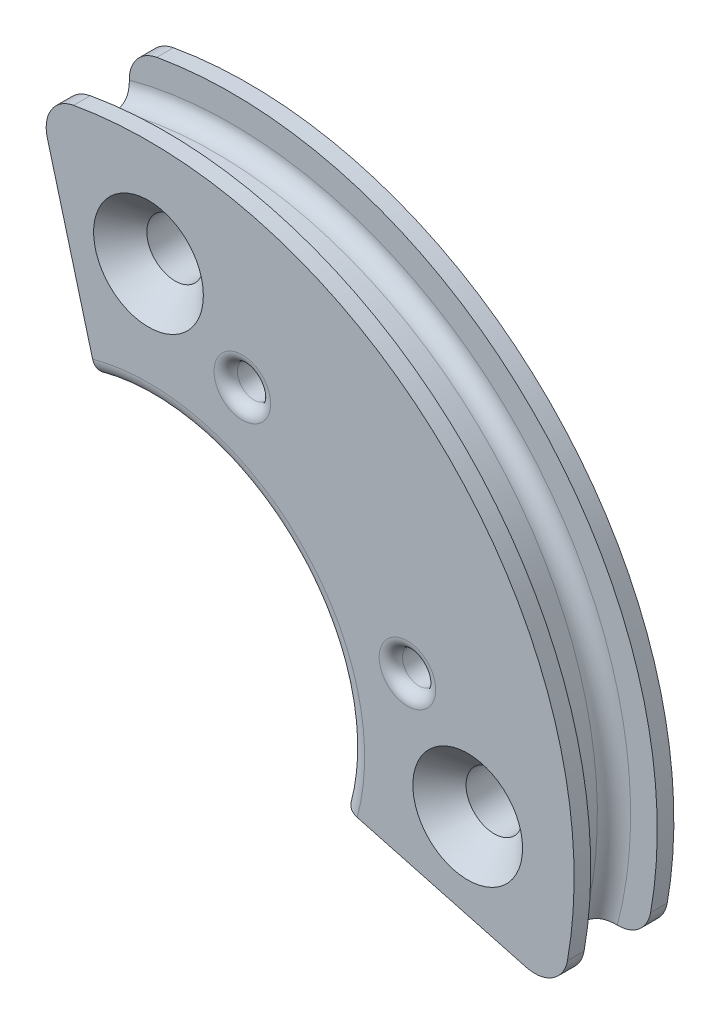
ISO-10303-21;
HEADER;
FILE_DESCRIPTION(('STEP AP214'),'2;1');
FILE_NAME('part.step','',(''),(''),'','','');
FILE_SCHEMA(('AUTOMOTIVE_DESIGN { 1 0 10303 214 1 1 1 1 }'));
ENDSEC;
DATA;
#1=APPLICATION_CONTEXT('core data for automotive mechanical design processes');
#2=APPLICATION_PROTOCOL_DEFINITION('international standard','automotive_design',2000,#1);
#3=PRODUCT_CONTEXT('',#1,'mechanical');
#4=PRODUCT('Part','Part','',(#3));
#5=PRODUCT_RELATED_PRODUCT_CATEGORY('part','',(#4));
#6=PRODUCT_DEFINITION_FORMATION('','',#4);
#7=PRODUCT_DEFINITION_CONTEXT('part definition',#1,'design');
#8=PRODUCT_DEFINITION('design','',#6,#7);
#9=PRODUCT_DEFINITION_SHAPE('','',#8);
#10=(LENGTH_UNIT() NAMED_UNIT(*) SI_UNIT(.MILLI.,.METRE.));
#11=(NAMED_UNIT(*) PLANE_ANGLE_UNIT() SI_UNIT($,.RADIAN.));
#12=(NAMED_UNIT(*) SI_UNIT($,.STERADIAN.) SOLID_ANGLE_UNIT());
#13=UNCERTAINTY_MEASURE_WITH_UNIT(LENGTH_MEASURE(1.E-05),#10,'distance_accuracy_value','');
#14=(GEOMETRIC_REPRESENTATION_CONTEXT(3) GLOBAL_UNCERTAINTY_ASSIGNED_CONTEXT((#13)) GLOBAL_UNIT_ASSIGNED_CONTEXT((#10,
#11,#12)) REPRESENTATION_CONTEXT('',''));
#15=CARTESIAN_POINT('',(0.,0.,0.));
#16=DIRECTION('',(0.,0.,1.));
#17=DIRECTION('',(1.,0.,0.));
#18=AXIS2_PLACEMENT_3D('',#15,#16,#17);
#19=CARTESIAN_POINT('',(0.,0.,1.5));
#20=DIRECTION('',(0.,0.,1.));
#21=DIRECTION('',(1.,0.,0.));
#22=AXIS2_PLACEMENT_3D('',#19,#20,#21);
#23=PLANE('',#22);
#24=CARTESIAN_POINT('',(2.82143232026971,7.78746026853087,1.5));
#25=DIRECTION('',(0.,0.,1.));
#26=DIRECTION('',(1.,0.,0.));
#27=AXIS2_PLACEMENT_3D('',#24,#25,#26);
#28=CIRCLE('',#27,0.85);
#29=CARTESIAN_POINT('',(3.67143232026971,7.78746026853087,1.5));
#30=VERTEX_POINT('',#29);
#31=EDGE_CURVE('E350',#30,#30,#28,.F.);
#32=ORIENTED_EDGE('',*,*,#31,.T.);
#33=EDGE_LOOP('',(#32));
#34=FACE_BOUND('',#33,.T.);
#35=CARTESIAN_POINT('',(7.78746026853084,2.82143232026975,1.5));
#36=DIRECTION('',(0.,0.,1.));
#37=DIRECTION('',(1.,0.,0.));
#38=AXIS2_PLACEMENT_3D('',#35,#36,#37);
#39=CIRCLE('',#38,0.850000000000001);
#40=CARTESIAN_POINT('',(8.63746026853084,2.82143232026975,1.5));
#41=VERTEX_POINT('',#40);
#42=EDGE_CURVE('E347',#41,#41,#39,.F.);
#43=ORIENTED_EDGE('',*,*,#42,.T.);
#44=EDGE_LOOP('',(#43));
#45=FACE_BOUND('',#44,.T.);
#46=CARTESIAN_POINT('',(9.6,0.,1.5));
#47=DIRECTION('',(0.,0.,1.));
#48=DIRECTION('',(1.,0.,0.));
#49=AXIS2_PLACEMENT_3D('',#46,#47,#48);
#50=CIRCLE('',#49,1.65);
#51=CARTESIAN_POINT('',(11.25,0.,1.5));
#52=VERTEX_POINT('',#51);
#53=EDGE_CURVE('E338',#52,#52,#50,.F.);
#54=ORIENTED_EDGE('',*,*,#53,.T.);
#55=EDGE_LOOP('',(#54));
#56=FACE_BOUND('',#55,.T.);
#57=CARTESIAN_POINT('',(1.00554662558682E-13,9.6,1.5));
#58=DIRECTION('',(0.,0.,1.));
#59=DIRECTION('',(1.,0.,0.));
#60=AXIS2_PLACEMENT_3D('',#57,#58,#59);
#61=CIRCLE('',#60,1.65);
#62=CARTESIAN_POINT('',(1.6500000000001,9.6,1.5));
#63=VERTEX_POINT('',#62);
#64=EDGE_CURVE('E335',#63,#63,#61,.F.);
#65=ORIENTED_EDGE('',*,*,#64,.T.);
#66=EDGE_LOOP('',(#65));
#67=FACE_BOUND('',#66,.T.);
#68=DIRECTION('',(-0.965925826289068,0.258819045102521,0.));
#69=VECTOR('',#68,1.);
#70=CARTESIAN_POINT('',(14.9002332262777,-3.9925054600165,1.5));
#71=LINE('',#70,#69);
#72=CARTESIAN_POINT('',(11.3569219381653,-3.0430780618347,1.5));
#73=VERTEX_POINT('',#72);
#74=CARTESIAN_POINT('',(6.27851787087894,-1.68232379316639,1.5));
#75=VERTEX_POINT('',#74);
#76=EDGE_CURVE('E467',#73,#75,#71,.T.);
#77=ORIENTED_EDGE('',*,*,#76,.F.);
#78=CARTESIAN_POINT('',(11.6157409832678,-2.07715223554563,1.5));
#79=DIRECTION('',(0.,0.,1.));
#80=DIRECTION('',(1.,0.,0.));
#81=AXIS2_PLACEMENT_3D('',#78,#79,#80);
#82=CIRCLE('',#81,1.);
#83=CARTESIAN_POINT('',(12.6001258123583,-2.2531820860156,1.5));
#84=VERTEX_POINT('',#83);
#85=EDGE_CURVE('E309',#73,#84,#82,.T.);
#86=ORIENTED_EDGE('',*,*,#85,.T.);
#87=CARTESIAN_POINT('',(0.,0.,1.5));
#88=DIRECTION('',(0.,0.,1.));
#89=DIRECTION('',(1.,0.,0.));
#90=AXIS2_PLACEMENT_3D('',#87,#88,#89);
#91=CIRCLE('',#90,12.8);
#92=CARTESIAN_POINT('',(-2.25318208601565,12.6001258123583,1.5));
#93=VERTEX_POINT('',#92);
#94=EDGE_CURVE('E443',#84,#93,#91,.T.);
#95=ORIENTED_EDGE('',*,*,#94,.T.);
#96=CARTESIAN_POINT('',(-2.07715223554568,11.6157409832678,1.5));
#97=DIRECTION('',(0.,0.,1.));
#98=DIRECTION('',(1.,0.,0.));
#99=AXIS2_PLACEMENT_3D('',#96,#97,#98);
#100=CIRCLE('',#99,1.);
#101=CARTESIAN_POINT('',(-3.04307806183475,11.3569219381653,1.5));
#102=VERTEX_POINT('',#101);
#103=EDGE_CURVE('E306',#93,#102,#100,.T.);
#104=ORIENTED_EDGE('',*,*,#103,.T.);
#105=DIRECTION('',(-0.258819045102525,0.965925826289067,0.));
#106=VECTOR('',#105,1.);
#107=CARTESIAN_POINT('',(-3.74363575167314,13.9714388302752,1.5));
#108=LINE('',#107,#106);
#109=CARTESIAN_POINT('',(-1.68232379316641,6.27851787087894,1.5));
#110=VERTEX_POINT('',#109);
#111=EDGE_CURVE('E465',#110,#102,#108,.T.);
#112=ORIENTED_EDGE('',*,*,#111,.F.);
#113=CARTESIAN_POINT('',(0.,0.,1.5));
#114=DIRECTION('',(0.,0.,1.));
#115=DIRECTION('',(1.,0.,0.));
#116=AXIS2_PLACEMENT_3D('',#113,#114,#115);
#117=CIRCLE('',#116,6.5);
#118=EDGE_CURVE('E192',#110,#75,#117,.F.);
#119=ORIENTED_EDGE('',*,*,#118,.T.);
#120=EDGE_LOOP('',(#77,#86,#95,#104,#112,#119));
#121=FACE_BOUND('',#120,.T.);
#122=ADVANCED_FACE('F33',(#34,#45,#56,#67,#121),#23,.T.);
#123=CARTESIAN_POINT('',(0.,0.,-1.5));
#124=DIRECTION('',(0.,0.,1.));
#125=DIRECTION('',(1.,0.,0.));
#126=AXIS2_PLACEMENT_3D('',#123,#124,#125);
#127=PLANE('',#126);
#128=CARTESIAN_POINT('',(7.78746026853084,2.82143232026975,-1.5));
#129=DIRECTION('',(0.,0.,1.));
#130=DIRECTION('',(1.,0.,0.));
#131=AXIS2_PLACEMENT_3D('',#128,#129,#130);
#132=CIRCLE('',#131,0.850000000000001);
#133=CARTESIAN_POINT('',(8.63746026853084,2.82143232026975,-1.5));
#134=VERTEX_POINT('',#133);
#135=EDGE_CURVE('E358',#134,#134,#132,.T.);
#136=ORIENTED_EDGE('',*,*,#135,.T.);
#137=EDGE_LOOP('',(#136));
#138=FACE_BOUND('',#137,.T.);
#139=CARTESIAN_POINT('',(2.82143232026971,7.78746026853087,-1.5));
#140=DIRECTION('',(0.,0.,1.));
#141=DIRECTION('',(1.,0.,0.));
#142=AXIS2_PLACEMENT_3D('',#139,#140,#141);
#143=CIRCLE('',#142,0.85);
#144=CARTESIAN_POINT('',(3.67143232026971,7.78746026853087,-1.5));
#145=VERTEX_POINT('',#144);
#146=EDGE_CURVE('E355',#145,#145,#143,.T.);
#147=ORIENTED_EDGE('',*,*,#146,.T.);
#148=EDGE_LOOP('',(#147));
#149=FACE_BOUND('',#148,.T.);
#150=CARTESIAN_POINT('',(0.,0.,-1.5));
#151=DIRECTION('',(0.,0.,1.));
#152=DIRECTION('',(1.,0.,0.));
#153=AXIS2_PLACEMENT_3D('',#150,#151,#152);
#154=CIRCLE('',#153,12.8);
#155=CARTESIAN_POINT('',(12.6001258123583,-2.2531820860156,-1.5));
#156=VERTEX_POINT('',#155);
#157=CARTESIAN_POINT('',(-2.25318208601565,12.6001258123583,-1.5));
#158=VERTEX_POINT('',#157);
#159=EDGE_CURVE('E375',#156,#158,#154,.T.);
#160=ORIENTED_EDGE('',*,*,#159,.F.);
#161=CARTESIAN_POINT('',(11.6157409832678,-2.07715223554563,-1.5));
#162=DIRECTION('',(0.,0.,1.));
#163=DIRECTION('',(1.,0.,0.));
#164=AXIS2_PLACEMENT_3D('',#161,#162,#163);
#165=CIRCLE('',#164,1.);
#166=CARTESIAN_POINT('',(11.3569219381653,-3.0430780618347,-1.5));
#167=VERTEX_POINT('',#166);
#168=EDGE_CURVE('E300',#156,#167,#165,.F.);
#169=ORIENTED_EDGE('',*,*,#168,.T.);
#170=DIRECTION('',(-0.965925826289068,0.258819045102521,0.));
#171=VECTOR('',#170,1.);
#172=CARTESIAN_POINT('',(14.9002332262777,-3.9925054600165,-1.5));
#173=LINE('',#172,#171);
#174=CARTESIAN_POINT('',(6.27851787087894,-1.68232379316639,-1.5));
#175=VERTEX_POINT('',#174);
#176=EDGE_CURVE('E463',#167,#175,#173,.T.);
#177=ORIENTED_EDGE('',*,*,#176,.T.);
#178=CARTESIAN_POINT('',(0.,0.,-1.5));
#179=DIRECTION('',(0.,0.,1.));
#180=DIRECTION('',(1.,0.,0.));
#181=AXIS2_PLACEMENT_3D('',#178,#179,#180);
#182=CIRCLE('',#181,6.5);
#183=CARTESIAN_POINT('',(-1.68232379316641,6.27851787087894,-1.5));
#184=VERTEX_POINT('',#183);
#185=EDGE_CURVE('E200',#175,#184,#182,.T.);
#186=ORIENTED_EDGE('',*,*,#185,.T.);
#187=DIRECTION('',(-0.258819045102525,0.965925826289067,0.));
#188=VECTOR('',#187,1.);
#189=CARTESIAN_POINT('',(-3.74363575167314,13.9714388302752,-1.5));
#190=LINE('',#189,#188);
#191=CARTESIAN_POINT('',(-3.04307806183475,11.3569219381653,-1.5));
#192=VERTEX_POINT('',#191);
#193=EDGE_CURVE('E154',#184,#192,#190,.T.);
#194=ORIENTED_EDGE('',*,*,#193,.T.);
#195=CARTESIAN_POINT('',(-2.07715223554568,11.6157409832678,-1.5));
#196=DIRECTION('',(0.,0.,1.));
#197=DIRECTION('',(1.,0.,0.));
#198=AXIS2_PLACEMENT_3D('',#195,#196,#197);
#199=CIRCLE('',#198,1.);
#200=EDGE_CURVE('E307',#192,#158,#199,.F.);
#201=ORIENTED_EDGE('',*,*,#200,.T.);
#202=EDGE_LOOP('',(#160,#169,#177,#186,#194,#201));
#203=FACE_BOUND('',#202,.T.);
#204=CARTESIAN_POINT('',(9.6,0.,-1.5));
#205=DIRECTION('',(0.,0.,1.));
#206=DIRECTION('',(1.,0.,0.));
#207=AXIS2_PLACEMENT_3D('',#204,#205,#206);
#208=CIRCLE('',#207,0.85);
#209=CARTESIAN_POINT('',(10.45,0.,-1.5));
#210=VERTEX_POINT('',#209);
#211=EDGE_CURVE('E180',#210,#210,#208,.T.);
#212=ORIENTED_EDGE('',*,*,#211,.T.);
#213=EDGE_LOOP('',(#212));
#214=FACE_BOUND('',#213,.T.);
#215=CARTESIAN_POINT('',(1.00554662558682E-13,9.6,-1.5));
#216=DIRECTION('',(0.,0.,1.));
#217=DIRECTION('',(1.,0.,0.));
#218=AXIS2_PLACEMENT_3D('',#215,#216,#217);
#219=CIRCLE('',#218,0.85);
#220=CARTESIAN_POINT('',(0.8500000000001,9.6,-1.5));
#221=VERTEX_POINT('',#220);
#222=EDGE_CURVE('E172',#221,#221,#219,.T.);
#223=ORIENTED_EDGE('',*,*,#222,.T.);
#224=EDGE_LOOP('',(#223));
#225=FACE_BOUND('',#224,.T.);
#226=ADVANCED_FACE('F267',(#138,#149,#203,#214,#225),#127,.F.);
#227=CARTESIAN_POINT('',(0.,0.,1.5));
#228=DIRECTION('',(0.,0.,-1.));
#229=DIRECTION('',(-1.,0.,0.));
#230=AXIS2_PLACEMENT_3D('',#227,#228,#229);
#231=CYLINDRICAL_SURFACE('',#230,6.);
#232=DIRECTION('',(0.,0.,-1.));
#233=VECTOR('',#232,1.);
#234=CARTESIAN_POINT('',(5.79555495773441,-1.55291427061513,1.5));
#235=LINE('',#234,#233);
#236=CARTESIAN_POINT('',(5.79555495773441,-1.55291427061513,1.));
#237=VERTEX_POINT('',#236);
#238=CARTESIAN_POINT('',(5.79555495773441,-1.55291427061513,-1.));
#239=VERTEX_POINT('',#238);
#240=EDGE_CURVE('E449',#237,#239,#235,.T.);
#241=ORIENTED_EDGE('',*,*,#240,.F.);
#242=CARTESIAN_POINT('',(0.,0.,1.));
#243=DIRECTION('',(0.,0.,1.));
#244=DIRECTION('',(1.,0.,0.));
#245=AXIS2_PLACEMENT_3D('',#242,#243,#244);
#246=CIRCLE('',#245,6.);
#247=CARTESIAN_POINT('',(-1.55291427061515,5.7955549577344,1.));
#248=VERTEX_POINT('',#247);
#249=EDGE_CURVE('E185',#237,#248,#246,.T.);
#250=ORIENTED_EDGE('',*,*,#249,.T.);
#251=DIRECTION('',(0.,0.,-1.));
#252=VECTOR('',#251,1.);
#253=CARTESIAN_POINT('',(-1.55291427061515,5.7955549577344,1.5));
#254=LINE('',#253,#252);
#255=CARTESIAN_POINT('',(-1.55291427061515,5.7955549577344,-1.));
#256=VERTEX_POINT('',#255);
#257=EDGE_CURVE('E457',#256,#248,#254,.F.);
#258=ORIENTED_EDGE('',*,*,#257,.F.);
#259=CARTESIAN_POINT('',(0.,0.,-1.));
#260=DIRECTION('',(0.,0.,1.));
#261=DIRECTION('',(1.,0.,0.));
#262=AXIS2_PLACEMENT_3D('',#259,#260,#261);
#263=CIRCLE('',#262,6.);
#264=EDGE_CURVE('E183',#256,#239,#263,.F.);
#265=ORIENTED_EDGE('',*,*,#264,.T.);
#266=EDGE_LOOP('',(#241,#250,#258,#265));
#267=FACE_BOUND('',#266,.T.);
#268=ADVANCED_FACE('F273',(#267),#231,.F.);
#269=CARTESIAN_POINT('',(9.6,0.,1.5));
#270=DIRECTION('',(0.,0.,-1.));
#271=DIRECTION('',(-1.,0.,0.));
#272=AXIS2_PLACEMENT_3D('',#269,#270,#271);
#273=CYLINDRICAL_SURFACE('',#272,0.85);
#274=CARTESIAN_POINT('',(9.6,0.,0.700000000000005));
#275=DIRECTION('',(0.,0.,1.));
#276=DIRECTION('',(1.,0.,0.));
#277=AXIS2_PLACEMENT_3D('',#274,#275,#276);
#278=CIRCLE('',#277,0.85);
#279=CARTESIAN_POINT('',(10.45,0.,0.700000000000005));
#280=VERTEX_POINT('',#279);
#281=EDGE_CURVE('E330',#280,#280,#278,.T.);
#282=ORIENTED_EDGE('',*,*,#281,.T.);
#283=EDGE_LOOP('',(#282));
#284=FACE_BOUND('',#283,.T.);
#285=ORIENTED_EDGE('',*,*,#211,.F.);
#286=EDGE_LOOP('',(#285));
#287=FACE_BOUND('',#286,.T.);
#288=ADVANCED_FACE('F381',(#284,#287),#273,.F.);
#289=CARTESIAN_POINT('',(1.00554662558682E-13,9.6,1.5));
#290=DIRECTION('',(0.,0.,-1.));
#291=DIRECTION('',(-1.,0.,0.));
#292=AXIS2_PLACEMENT_3D('',#289,#290,#291);
#293=CYLINDRICAL_SURFACE('',#292,0.85);
#294=CARTESIAN_POINT('',(1.00554662558682E-13,9.6,0.700000000000002));
#295=DIRECTION('',(0.,0.,1.));
#296=DIRECTION('',(1.,0.,0.));
#297=AXIS2_PLACEMENT_3D('',#294,#295,#296);
#298=CIRCLE('',#297,0.85);
#299=CARTESIAN_POINT('',(0.8500000000001,9.6,0.700000000000002));
#300=VERTEX_POINT('',#299);
#301=EDGE_CURVE('E341',#300,#300,#298,.T.);
#302=ORIENTED_EDGE('',*,*,#301,.T.);
#303=EDGE_LOOP('',(#302));
#304=FACE_BOUND('',#303,.T.);
#305=ORIENTED_EDGE('',*,*,#222,.F.);
#306=EDGE_LOOP('',(#305));
#307=FACE_BOUND('',#306,.T.);
#308=ADVANCED_FACE('F264',(#304,#307),#293,.F.);
#309=CARTESIAN_POINT('',(0.,0.,-0.499999999999998));
#310=DIRECTION('',(0.,0.,1.));
#311=DIRECTION('',(1.,0.,0.));
#312=AXIS2_PLACEMENT_3D('',#309,#310,#311);
#313=TOROIDAL_SURFACE('',#312,12.,0.500000000000002);
#314=CARTESIAN_POINT('',(11.5911099154688,-3.10582854123025,-0.499999999999998));
#315=DIRECTION('',(0.258819045102521,0.965925826289068,0.));
#316=DIRECTION('',(-0.965925826289068,0.258819045102521,0.));
#317=AXIS2_PLACEMENT_3D('',#314,#315,#316);
#318=CIRCLE('',#317,0.500000000000002);
#319=CARTESIAN_POINT('',(11.3569219381653,-3.0430780618347,-0.937285225707565));
#320=VERTEX_POINT('',#319);
#321=CARTESIAN_POINT('',(11.1081470023243,-2.97641901867899,-0.499999999999998));
#322=VERTEX_POINT('',#321);
#323=EDGE_CURVE('E452',#320,#322,#318,.T.);
#324=ORIENTED_EDGE('',*,*,#323,.F.);
#325=CARTESIAN_POINT('',(11.3569219381653,-3.0430780618347,-0.937285225707565));
#326=CARTESIAN_POINT('',(11.3788907022271,-3.04899831611114,-0.949943539683777));
#327=CARTESIAN_POINT('',(11.4020780861868,-3.05437532809976,-0.960766771828405));
#328=CARTESIAN_POINT('',(11.4496007428172,-3.06353569894288,-0.978371417856458));
#329=CARTESIAN_POINT('',(11.4738969178736,-3.06735312809629,-0.985240754489292));
#330=CARTESIAN_POINT('',(11.5149442494263,-3.07219577508378,-0.993465018538642));
#331=CARTESIAN_POINT('',(11.531426924697,-3.07372956647898,-0.995903041619362));
#332=CARTESIAN_POINT('',(11.5648655383223,-3.07600064981872,-0.999184648848311));
#333=CARTESIAN_POINT('',(11.581824849703,-3.07672517119939,-1.00000282200904));
#334=CARTESIAN_POINT('',(11.59879381403,-3.07700862196078,-1.00000000000002));
#335=B_SPLINE_CURVE_WITH_KNOTS('',3,(#325,#326,#327,#328,#329,#330,#331,#332,#333,#334),
.UNSPECIFIED.,.F.,.F.,(4,2,2,2,4),(0.,0.0780439203151207,0.154277705368697,0.204380010066996,
0.25526224375088),.UNSPECIFIED.);
#336=CARTESIAN_POINT('',(11.59879381403,-3.0770086219606,-1.));
#337=VERTEX_POINT('',#336);
#338=EDGE_CURVE('E216',#320,#337,#335,.T.);
#339=ORIENTED_EDGE('',*,*,#338,.T.);
#340=CARTESIAN_POINT('',(0.,0.,-1.));
#341=DIRECTION('',(0.,0.,1.));
#342=DIRECTION('',(1.,0.,0.));
#343=AXIS2_PLACEMENT_3D('',#340,#341,#342);
#344=CIRCLE('',#343,12.);
#345=CARTESIAN_POINT('',(-3.07700862196066,11.59879381403,-1.));
#346=VERTEX_POINT('',#345);
#347=EDGE_CURVE('E174',#337,#346,#344,.T.);
#348=ORIENTED_EDGE('',*,*,#347,.T.);
#349=CARTESIAN_POINT('',(-3.07700862196066,11.59879381403,-1.));
#350=CARTESIAN_POINT('',(-3.07660458449419,11.5727601819554,-1.00003894836341));
#351=CARTESIAN_POINT('',(-3.07511026037198,11.5467286746794,-0.998086003587239));
#352=CARTESIAN_POINT('',(-3.07027226218953,11.4960485993055,-0.990321356288697));
#353=CARTESIAN_POINT('',(-3.06697226123266,11.4713819615224,-0.984600153749769));
#354=CARTESIAN_POINT('',(-3.06020836080265,11.4317329932909,-0.972022151730217));
#355=CARTESIAN_POINT('',(-3.05718836163848,11.4163292860042,-0.966226791143053));
#356=CARTESIAN_POINT('',(-3.05054927334866,11.386085156282,-0.952986500989708));
#357=CARTESIAN_POINT('',(-3.0469215908292,11.3712572336561,-0.945517299304913));
#358=CARTESIAN_POINT('',(-3.04307806183475,11.3569219381653,-0.937285225707566));
#359=B_SPLINE_CURVE_WITH_KNOTS('',3,(#349,#350,#351,#352,#353,#354,#355,#356,#357,#358),
.UNSPECIFIED.,.F.,.F.,(4,2,2,2,4),(0.,0.0780427071951764,0.154276292796439,0.204379307922696,
0.255262197451977),.UNSPECIFIED.);
#360=CARTESIAN_POINT('',(-3.04307806183475,11.3569219381653,-0.937285225707565));
#361=VERTEX_POINT('',#360);
#362=EDGE_CURVE('E209',#346,#361,#359,.T.);
#363=ORIENTED_EDGE('',*,*,#362,.T.);
#364=CARTESIAN_POINT('',(-3.1058285412303,11.5911099154688,-0.499999999999998));
#365=DIRECTION('',(0.965925826289067,0.258819045102525,0.));
#366=DIRECTION('',(-0.258819045102525,0.965925826289067,0.));
#367=AXIS2_PLACEMENT_3D('',#364,#365,#366);
#368=CIRCLE('',#367,0.500000000000002);
#369=CARTESIAN_POINT('',(-2.97641901867904,11.1081470023243,-0.499999999999998));
#370=VERTEX_POINT('',#369);
#371=EDGE_CURVE('E164',#370,#361,#368,.T.);
#372=ORIENTED_EDGE('',*,*,#371,.F.);
#373=CARTESIAN_POINT('',(0.,0.,-0.499999999999998));
#374=DIRECTION('',(0.,0.,1.));
#375=DIRECTION('',(1.,0.,0.));
#376=AXIS2_PLACEMENT_3D('',#373,#374,#375);
#377=CIRCLE('',#376,11.5);
#378=EDGE_CURVE('E163',#322,#370,#377,.T.);
#379=ORIENTED_EDGE('',*,*,#378,.F.);
#380=EDGE_LOOP('',(#324,#339,#348,#363,#372,#379));
#381=FACE_BOUND('',#380,.T.);
#382=ADVANCED_FACE('F222',(#381),#313,.F.);
#383=CARTESIAN_POINT('',(0.,0.,0.));
#384=DIRECTION('',(0.,0.,1.));
#385=DIRECTION('',(1.,0.,0.));
#386=AXIS2_PLACEMENT_3D('',#383,#384,#385);
#387=CYLINDRICAL_SURFACE('',#386,11.5);
#388=DIRECTION('',(0.,0.,1.));
#389=VECTOR('',#388,1.);
#390=CARTESIAN_POINT('',(11.1081470023243,-2.97641901867899,0.));
#391=LINE('',#390,#389);
#392=CARTESIAN_POINT('',(11.1081470023243,-2.97641901867899,0.499999999999998));
#393=VERTEX_POINT('',#392);
#394=EDGE_CURVE('E454',#322,#393,#391,.T.);
#395=ORIENTED_EDGE('',*,*,#394,.F.);
#396=ORIENTED_EDGE('',*,*,#378,.T.);
#397=DIRECTION('',(0.,0.,1.));
#398=VECTOR('',#397,1.);
#399=CARTESIAN_POINT('',(-2.97641901867904,11.1081470023243,0.));
#400=LINE('',#399,#398);
#401=CARTESIAN_POINT('',(-2.97641901867904,11.1081470023243,0.499999999999998));
#402=VERTEX_POINT('',#401);
#403=EDGE_CURVE('E149',#402,#370,#400,.F.);
#404=ORIENTED_EDGE('',*,*,#403,.F.);
#405=CARTESIAN_POINT('',(0.,0.,0.499999999999998));
#406=DIRECTION('',(0.,0.,1.));
#407=DIRECTION('',(1.,0.,0.));
#408=AXIS2_PLACEMENT_3D('',#405,#406,#407);
#409=CIRCLE('',#408,11.5);
#410=EDGE_CURVE('E161',#393,#402,#409,.T.);
#411=ORIENTED_EDGE('',*,*,#410,.F.);
#412=EDGE_LOOP('',(#395,#396,#404,#411));
#413=FACE_BOUND('',#412,.T.);
#414=ADVANCED_FACE('F160',(#413),#387,.T.);
#415=CARTESIAN_POINT('',(0.,0.,0.499999999999998));
#416=DIRECTION('',(0.,0.,1.));
#417=DIRECTION('',(1.,0.,0.));
#418=AXIS2_PLACEMENT_3D('',#415,#416,#417);
#419=TOROIDAL_SURFACE('',#418,12.,0.500000000000002);
#420=CARTESIAN_POINT('',(0.,0.,1.));
#421=DIRECTION('',(0.,0.,1.));
#422=DIRECTION('',(1.,0.,0.));
#423=AXIS2_PLACEMENT_3D('',#420,#421,#422);
#424=CIRCLE('',#423,12.);
#425=CARTESIAN_POINT('',(11.59879381403,-3.07700862196061,1.));
#426=VERTEX_POINT('',#425);
#427=CARTESIAN_POINT('',(-3.07700862196067,11.59879381403,1.));
#428=VERTEX_POINT('',#427);
#429=EDGE_CURVE('E170',#426,#428,#424,.T.);
#430=ORIENTED_EDGE('',*,*,#429,.F.);
#431=CARTESIAN_POINT('',(11.59879381403,-3.07700862196061,1.));
#432=CARTESIAN_POINT('',(11.5727601819554,-3.07660458449414,1.00003894836341));
#433=CARTESIAN_POINT('',(11.5467286746794,-3.07511026037193,0.998086003587239));
#434=CARTESIAN_POINT('',(11.4960485993056,-3.07027226218948,0.990321356288697));
#435=CARTESIAN_POINT('',(11.4713819615224,-3.06697226123261,0.984600153749768));
#436=CARTESIAN_POINT('',(11.4317329932909,-3.0602083608026,0.972022151730217));
#437=CARTESIAN_POINT('',(11.4163292860042,-3.05718836163843,0.966226791143054));
#438=CARTESIAN_POINT('',(11.386085156282,-3.05054927334861,0.952986500989709));
#439=CARTESIAN_POINT('',(11.3712572336561,-3.04692159082915,0.945517299304914));
#440=CARTESIAN_POINT('',(11.3569219381653,-3.0430780618347,0.937285225707565));
#441=B_SPLINE_CURVE_WITH_KNOTS('',3,(#431,#432,#433,#434,#435,#436,#437,#438,#439,#440),
.UNSPECIFIED.,.F.,.F.,(4,2,2,2,4),(0.,0.0780427071951764,0.154276292796439,0.204379307922698,
0.255262197451979),.UNSPECIFIED.);
#442=CARTESIAN_POINT('',(11.3569219381653,-3.0430780618347,0.937285225707565));
#443=VERTEX_POINT('',#442);
#444=EDGE_CURVE('E247',#426,#443,#441,.T.);
#445=ORIENTED_EDGE('',*,*,#444,.T.);
#446=CARTESIAN_POINT('',(11.5911099154688,-3.10582854123025,0.499999999999998));
#447=DIRECTION('',(0.258819045102521,0.965925826289068,0.));
#448=DIRECTION('',(-0.965925826289068,0.258819045102521,0.));
#449=AXIS2_PLACEMENT_3D('',#446,#447,#448);
#450=CIRCLE('',#449,0.500000000000002);
#451=EDGE_CURVE('E169',#393,#443,#450,.T.);
#452=ORIENTED_EDGE('',*,*,#451,.F.);
#453=ORIENTED_EDGE('',*,*,#410,.T.);
#454=CARTESIAN_POINT('',(-3.1058285412303,11.5911099154688,0.499999999999998));
#455=DIRECTION('',(0.965925826289067,0.258819045102525,0.));
#456=DIRECTION('',(-0.258819045102525,0.965925826289067,0.));
#457=AXIS2_PLACEMENT_3D('',#454,#455,#456);
#458=CIRCLE('',#457,0.500000000000002);
#459=CARTESIAN_POINT('',(-3.04307806183475,11.3569219381653,0.937285225707565));
#460=VERTEX_POINT('',#459);
#461=EDGE_CURVE('E145',#460,#402,#458,.T.);
#462=ORIENTED_EDGE('',*,*,#461,.F.);
#463=CARTESIAN_POINT('',(-3.04307806183475,11.3569219381653,0.937285225707565));
#464=CARTESIAN_POINT('',(-3.04899831611119,11.3788907022271,0.949943539683777));
#465=CARTESIAN_POINT('',(-3.05437532809981,11.4020780861868,0.960766771828404));
#466=CARTESIAN_POINT('',(-3.06353569894293,11.4496007428172,0.978371417856458));
#467=CARTESIAN_POINT('',(-3.06735312809634,11.4738969178736,0.985240754489291));
#468=CARTESIAN_POINT('',(-3.07219577508383,11.5149442494263,0.993465018538642));
#469=CARTESIAN_POINT('',(-3.07372956647903,11.5314269246969,0.995903041619362));
#470=CARTESIAN_POINT('',(-3.07600064981877,11.5648655383223,0.999184648848312));
#471=CARTESIAN_POINT('',(-3.07672517119944,11.5818248497029,1.00000282200904));
#472=CARTESIAN_POINT('',(-3.07700862196083,11.5987938140299,1.00000000000002));
#473=B_SPLINE_CURVE_WITH_KNOTS('',3,(#463,#464,#465,#466,#467,#468,#469,#470,#471,#472),
.UNSPECIFIED.,.F.,.F.,(4,2,2,2,4),(0.,0.0780439203151175,0.154277705368694,0.204380010066994,
0.255262243750883),.UNSPECIFIED.);
#474=EDGE_CURVE('E48',#460,#428,#473,.T.);
#475=ORIENTED_EDGE('',*,*,#474,.T.);
#476=EDGE_LOOP('',(#430,#445,#452,#453,#462,#475));
#477=FACE_BOUND('',#476,.T.);
#478=ADVANCED_FACE('F167',(#477),#419,.F.);
#479=CARTESIAN_POINT('',(12.,0.,-1.));
#480=DIRECTION('',(0.,0.,1.));
#481=DIRECTION('',(1.,0.,0.));
#482=AXIS2_PLACEMENT_3D('',#479,#480,#481);
#483=PLANE('',#482);
#484=ORIENTED_EDGE('',*,*,#347,.F.);
#485=CARTESIAN_POINT('',(11.6157409832678,-2.07715223554563,-1.));
#486=DIRECTION('',(0.,0.,1.));
#487=DIRECTION('',(1.,0.,0.));
#488=AXIS2_PLACEMENT_3D('',#485,#486,#487);
#489=CIRCLE('',#488,1.);
#490=CARTESIAN_POINT('',(12.6001258123583,-2.2531820860156,-1.));
#491=VERTEX_POINT('',#490);
#492=EDGE_CURVE('E486',#337,#491,#489,.T.);
#493=ORIENTED_EDGE('',*,*,#492,.T.);
#494=CARTESIAN_POINT('',(0.,0.,-1.));
#495=DIRECTION('',(0.,0.,1.));
#496=DIRECTION('',(1.,0.,0.));
#497=AXIS2_PLACEMENT_3D('',#494,#495,#496);
#498=CIRCLE('',#497,12.8);
#499=CARTESIAN_POINT('',(-2.25318208601565,12.6001258123583,-1.));
#500=VERTEX_POINT('',#499);
#501=EDGE_CURVE('E437',#491,#500,#498,.T.);
#502=ORIENTED_EDGE('',*,*,#501,.T.);
#503=CARTESIAN_POINT('',(-2.07715223554568,11.6157409832678,-1.));
#504=DIRECTION('',(0.,0.,1.));
#505=DIRECTION('',(1.,0.,0.));
#506=AXIS2_PLACEMENT_3D('',#503,#504,#505);
#507=CIRCLE('',#506,1.);
#508=EDGE_CURVE('E485',#500,#346,#507,.T.);
#509=ORIENTED_EDGE('',*,*,#508,.T.);
#510=EDGE_LOOP('',(#484,#493,#502,#509));
#511=FACE_BOUND('',#510,.T.);
#512=ADVANCED_FACE('F257',(#511),#483,.T.);
#513=CARTESIAN_POINT('',(0.,0.,0.));
#514=DIRECTION('',(0.,0.,1.));
#515=DIRECTION('',(1.,0.,0.));
#516=AXIS2_PLACEMENT_3D('',#513,#514,#515);
#517=CYLINDRICAL_SURFACE('',#516,12.8);
#518=ORIENTED_EDGE('',*,*,#501,.F.);
#519=DIRECTION('',(0.,0.,1.));
#520=VECTOR('',#519,1.);
#521=CARTESIAN_POINT('',(12.6001258123583,-2.2531820860156,0.));
#522=LINE('',#521,#520);
#523=EDGE_CURVE('E302',#491,#156,#522,.F.);
#524=ORIENTED_EDGE('',*,*,#523,.T.);
#525=ORIENTED_EDGE('',*,*,#159,.T.);
#526=DIRECTION('',(0.,0.,1.));
#527=VECTOR('',#526,1.);
#528=CARTESIAN_POINT('',(-2.25318208601565,12.6001258123583,0.));
#529=LINE('',#528,#527);
#530=EDGE_CURVE('E439',#158,#500,#529,.T.);
#531=ORIENTED_EDGE('',*,*,#530,.T.);
#532=EDGE_LOOP('',(#518,#524,#525,#531));
#533=FACE_BOUND('',#532,.T.);
#534=ADVANCED_FACE('F427',(#533),#517,.T.);
#535=CARTESIAN_POINT('',(0.,0.,0.));
#536=DIRECTION('',(0.,0.,1.));
#537=DIRECTION('',(1.,0.,0.));
#538=AXIS2_PLACEMENT_3D('',#535,#536,#537);
#539=CYLINDRICAL_SURFACE('',#538,12.8);
#540=ORIENTED_EDGE('',*,*,#94,.F.);
#541=DIRECTION('',(0.,0.,1.));
#542=VECTOR('',#541,1.);
#543=CARTESIAN_POINT('',(12.6001258123583,-2.2531820860156,0.));
#544=LINE('',#543,#542);
#545=CARTESIAN_POINT('',(12.6001258123583,-2.2531820860156,1.));
#546=VERTEX_POINT('',#545);
#547=EDGE_CURVE('E317',#84,#546,#544,.F.);
#548=ORIENTED_EDGE('',*,*,#547,.T.);
#549=CARTESIAN_POINT('',(0.,0.,1.));
#550=DIRECTION('',(0.,0.,1.));
#551=DIRECTION('',(1.,0.,0.));
#552=AXIS2_PLACEMENT_3D('',#549,#550,#551);
#553=CIRCLE('',#552,12.8);
#554=CARTESIAN_POINT('',(-2.25318208601565,12.6001258123583,1.));
#555=VERTEX_POINT('',#554);
#556=EDGE_CURVE('E324',#546,#555,#553,.T.);
#557=ORIENTED_EDGE('',*,*,#556,.T.);
#558=DIRECTION('',(0.,0.,1.));
#559=VECTOR('',#558,1.);
#560=CARTESIAN_POINT('',(-2.25318208601565,12.6001258123583,0.));
#561=LINE('',#560,#559);
#562=EDGE_CURVE('E315',#555,#93,#561,.T.);
#563=ORIENTED_EDGE('',*,*,#562,.T.);
#564=EDGE_LOOP('',(#540,#548,#557,#563));
#565=FACE_BOUND('',#564,.T.);
#566=ADVANCED_FACE('F425',(#565),#539,.T.);
#567=CARTESIAN_POINT('',(12.,0.,1.));
#568=DIRECTION('',(0.,0.,-1.));
#569=DIRECTION('',(-1.,0.,0.));
#570=AXIS2_PLACEMENT_3D('',#567,#568,#569);
#571=PLANE('',#570);
#572=ORIENTED_EDGE('',*,*,#556,.F.);
#573=CARTESIAN_POINT('',(11.6157409832678,-2.07715223554563,1.));
#574=DIRECTION('',(0.,0.,-1.));
#575=DIRECTION('',(-1.,0.,0.));
#576=AXIS2_PLACEMENT_3D('',#573,#574,#575);
#577=CIRCLE('',#576,1.);
#578=EDGE_CURVE('E248',#546,#426,#577,.T.);
#579=ORIENTED_EDGE('',*,*,#578,.T.);
#580=ORIENTED_EDGE('',*,*,#429,.T.);
#581=CARTESIAN_POINT('',(-2.07715223554568,11.6157409832678,1.));
#582=DIRECTION('',(0.,0.,-1.));
#583=DIRECTION('',(-1.,0.,0.));
#584=AXIS2_PLACEMENT_3D('',#581,#582,#583);
#585=CIRCLE('',#584,1.);
#586=EDGE_CURVE('E318',#428,#555,#585,.T.);
#587=ORIENTED_EDGE('',*,*,#586,.T.);
#588=EDGE_LOOP('',(#572,#579,#580,#587));
#589=FACE_BOUND('',#588,.T.);
#590=ADVANCED_FACE('F323',(#589),#571,.T.);
#591=CARTESIAN_POINT('',(-3.74363575167314,13.9714388302752,-1.5));
#592=DIRECTION('',(0.965925826289067,0.258819045102525,0.));
#593=DIRECTION('',(-0.258819045102525,0.965925826289067,0.));
#594=AXIS2_PLACEMENT_3D('',#591,#592,#593);
#595=PLANE('',#594);
#596=ORIENTED_EDGE('',*,*,#371,.T.);
#597=DIRECTION('',(0.,0.,-1.));
#598=VECTOR('',#597,1.);
#599=CARTESIAN_POINT('',(-3.04307806183475,11.3569219381653,-1.5));
#600=LINE('',#599,#598);
#601=EDGE_CURVE('E328',#361,#192,#600,.T.);
#602=ORIENTED_EDGE('',*,*,#601,.T.);
#603=ORIENTED_EDGE('',*,*,#193,.F.);
#604=CARTESIAN_POINT('',(-1.68232379316641,6.27851787087894,-1.));
#605=DIRECTION('',(0.965925826289067,0.258819045102525,0.));
#606=DIRECTION('',(-0.258819045102525,0.965925826289067,0.));
#607=AXIS2_PLACEMENT_3D('',#604,#605,#606);
#608=CIRCLE('',#607,0.5);
#609=EDGE_CURVE('E188',#184,#256,#608,.F.);
#610=ORIENTED_EDGE('',*,*,#609,.T.);
#611=ORIENTED_EDGE('',*,*,#257,.T.);
#612=CARTESIAN_POINT('',(-1.68232379316641,6.27851787087894,1.));
#613=DIRECTION('',(0.965925826289067,0.258819045102525,0.));
#614=DIRECTION('',(-0.258819045102525,0.965925826289067,0.));
#615=AXIS2_PLACEMENT_3D('',#612,#613,#614);
#616=CIRCLE('',#615,0.5);
#617=EDGE_CURVE('E190',#248,#110,#616,.F.);
#618=ORIENTED_EDGE('',*,*,#617,.T.);
#619=ORIENTED_EDGE('',*,*,#111,.T.);
#620=DIRECTION('',(0.,0.,-1.));
#621=VECTOR('',#620,1.);
#622=CARTESIAN_POINT('',(-3.04307806183475,11.3569219381653,1.));
#623=LINE('',#622,#621);
#624=EDGE_CURVE('E152',#102,#460,#623,.T.);
#625=ORIENTED_EDGE('',*,*,#624,.T.);
#626=ORIENTED_EDGE('',*,*,#461,.T.);
#627=ORIENTED_EDGE('',*,*,#403,.T.);
#628=EDGE_LOOP('',(#596,#602,#603,#610,#611,#618,#619,#625,#626,#627));
#629=FACE_BOUND('',#628,.T.);
#630=ADVANCED_FACE('F148',(#629),#595,.F.);
#631=CARTESIAN_POINT('',(14.9002332262777,-3.9925054600165,-1.5));
#632=DIRECTION('',(0.258819045102521,0.965925826289068,0.));
#633=DIRECTION('',(-0.965925826289068,0.258819045102521,0.));
#634=AXIS2_PLACEMENT_3D('',#631,#632,#633);
#635=PLANE('',#634);
#636=ORIENTED_EDGE('',*,*,#176,.F.);
#637=DIRECTION('',(0.,0.,-1.));
#638=VECTOR('',#637,1.);
#639=CARTESIAN_POINT('',(11.3569219381653,-3.0430780618347,-1.));
#640=LINE('',#639,#638);
#641=EDGE_CURVE('E206',#167,#320,#640,.F.);
#642=ORIENTED_EDGE('',*,*,#641,.T.);
#643=ORIENTED_EDGE('',*,*,#323,.T.);
#644=ORIENTED_EDGE('',*,*,#394,.T.);
#645=ORIENTED_EDGE('',*,*,#451,.T.);
#646=DIRECTION('',(0.,0.,-1.));
#647=VECTOR('',#646,1.);
#648=CARTESIAN_POINT('',(11.3569219381653,-3.0430780618347,1.5));
#649=LINE('',#648,#647);
#650=EDGE_CURVE('E203',#443,#73,#649,.F.);
#651=ORIENTED_EDGE('',*,*,#650,.T.);
#652=ORIENTED_EDGE('',*,*,#76,.T.);
#653=CARTESIAN_POINT('',(6.27851787087894,-1.68232379316639,1.));
#654=DIRECTION('',(0.258819045102521,0.965925826289068,0.));
#655=DIRECTION('',(-0.965925826289068,0.258819045102521,0.));
#656=AXIS2_PLACEMENT_3D('',#653,#654,#655);
#657=CIRCLE('',#656,0.5);
#658=EDGE_CURVE('E198',#75,#237,#657,.F.);
#659=ORIENTED_EDGE('',*,*,#658,.T.);
#660=ORIENTED_EDGE('',*,*,#240,.T.);
#661=CARTESIAN_POINT('',(6.27851787087894,-1.68232379316639,-1.));
#662=DIRECTION('',(0.258819045102521,0.965925826289068,0.));
#663=DIRECTION('',(-0.965925826289068,0.258819045102521,0.));
#664=AXIS2_PLACEMENT_3D('',#661,#662,#663);
#665=CIRCLE('',#664,0.5);
#666=EDGE_CURVE('E195',#239,#175,#665,.F.);
#667=ORIENTED_EDGE('',*,*,#666,.T.);
#668=EDGE_LOOP('',(#636,#642,#643,#644,#645,#651,#652,#659,#660,#667));
#669=FACE_BOUND('',#668,.T.);
#670=ADVANCED_FACE('F410',(#669),#635,.F.);
#671=CARTESIAN_POINT('',(7.78746026853084,2.82143232026975,-1.5));
#672=DIRECTION('',(0.,0.,1.));
#673=DIRECTION('',(1.,0.,0.));
#674=AXIS2_PLACEMENT_3D('',#671,#672,#673);
#675=CYLINDRICAL_SURFACE('',#674,0.500000000000001);
#676=CARTESIAN_POINT('',(7.78746026853084,2.82143232026975,-1.15));
#677=DIRECTION('',(0.,0.,1.));
#678=DIRECTION('',(1.,0.,0.));
#679=AXIS2_PLACEMENT_3D('',#676,#677,#678);
#680=CIRCLE('',#679,0.500000000000001);
#681=CARTESIAN_POINT('',(8.28746026853084,2.82143232026975,-1.15));
#682=VERTEX_POINT('',#681);
#683=EDGE_CURVE('E41',#682,#682,#680,.F.);
#684=ORIENTED_EDGE('',*,*,#683,.T.);
#685=EDGE_LOOP('',(#684));
#686=FACE_BOUND('',#685,.T.);
#687=CARTESIAN_POINT('',(7.78746026853084,2.82143232026975,1.15));
#688=DIRECTION('',(0.,0.,1.));
#689=DIRECTION('',(1.,0.,0.));
#690=AXIS2_PLACEMENT_3D('',#687,#688,#689);
#691=CIRCLE('',#690,0.500000000000001);
#692=CARTESIAN_POINT('',(8.28746026853084,2.82143232026975,1.15));
#693=VERTEX_POINT('',#692);
#694=EDGE_CURVE('E352',#693,#693,#691,.T.);
#695=ORIENTED_EDGE('',*,*,#694,.T.);
#696=EDGE_LOOP('',(#695));
#697=FACE_BOUND('',#696,.T.);
#698=ADVANCED_FACE('F363',(#686,#697),#675,.F.);
#699=CARTESIAN_POINT('',(2.82143232026971,7.78746026853087,-1.5));
#700=DIRECTION('',(0.,0.,1.));
#701=DIRECTION('',(1.,0.,0.));
#702=AXIS2_PLACEMENT_3D('',#699,#700,#701);
#703=CYLINDRICAL_SURFACE('',#702,0.5);
#704=CARTESIAN_POINT('',(2.82143232026971,7.78746026853087,-1.15));
#705=DIRECTION('',(0.,0.,1.));
#706=DIRECTION('',(1.,0.,0.));
#707=AXIS2_PLACEMENT_3D('',#704,#705,#706);
#708=CIRCLE('',#707,0.5);
#709=CARTESIAN_POINT('',(3.32143232026971,7.78746026853087,-1.15));
#710=VERTEX_POINT('',#709);
#711=EDGE_CURVE('E11',#710,#710,#708,.F.);
#712=ORIENTED_EDGE('',*,*,#711,.T.);
#713=EDGE_LOOP('',(#712));
#714=FACE_BOUND('',#713,.T.);
#715=CARTESIAN_POINT('',(2.82143232026971,7.78746026853087,1.15));
#716=DIRECTION('',(0.,0.,1.));
#717=DIRECTION('',(1.,0.,0.));
#718=AXIS2_PLACEMENT_3D('',#715,#716,#717);
#719=CIRCLE('',#718,0.5);
#720=CARTESIAN_POINT('',(3.32143232026971,7.78746026853087,1.15));
#721=VERTEX_POINT('',#720);
#722=EDGE_CURVE('E344',#721,#721,#719,.T.);
#723=ORIENTED_EDGE('',*,*,#722,.T.);
#724=EDGE_LOOP('',(#723));
#725=FACE_BOUND('',#724,.T.);
#726=ADVANCED_FACE('F285',(#714,#725),#703,.F.);
#727=CARTESIAN_POINT('',(0.,0.,1.));
#728=DIRECTION('',(0.,0.,1.));
#729=DIRECTION('',(1.,0.,0.));
#730=AXIS2_PLACEMENT_3D('',#727,#728,#729);
#731=TOROIDAL_SURFACE('',#730,6.5,0.5);
#732=ORIENTED_EDGE('',*,*,#658,.F.);
#733=ORIENTED_EDGE('',*,*,#118,.F.);
#734=ORIENTED_EDGE('',*,*,#617,.F.);
#735=ORIENTED_EDGE('',*,*,#249,.F.);
#736=EDGE_LOOP('',(#732,#733,#734,#735));
#737=FACE_BOUND('',#736,.T.);
#738=ADVANCED_FACE('F281',(#737),#731,.T.);
#739=CARTESIAN_POINT('',(0.,0.,-1.));
#740=DIRECTION('',(0.,0.,1.));
#741=DIRECTION('',(1.,0.,0.));
#742=AXIS2_PLACEMENT_3D('',#739,#740,#741);
#743=TOROIDAL_SURFACE('',#742,6.5,0.5);
#744=ORIENTED_EDGE('',*,*,#666,.F.);
#745=ORIENTED_EDGE('',*,*,#264,.F.);
#746=ORIENTED_EDGE('',*,*,#609,.F.);
#747=ORIENTED_EDGE('',*,*,#185,.F.);
#748=EDGE_LOOP('',(#744,#745,#746,#747));
#749=FACE_BOUND('',#748,.T.);
#750=ADVANCED_FACE('F284',(#749),#743,.T.);
#751=CARTESIAN_POINT('',(11.6157409832678,-2.07715223554563,0.));
#752=DIRECTION('',(0.,0.,1.));
#753=DIRECTION('',(1.,0.,0.));
#754=AXIS2_PLACEMENT_3D('',#751,#752,#753);
#755=CYLINDRICAL_SURFACE('',#754,1.);
#756=ORIENTED_EDGE('',*,*,#168,.F.);
#757=ORIENTED_EDGE('',*,*,#523,.F.);
#758=ORIENTED_EDGE('',*,*,#492,.F.);
#759=ORIENTED_EDGE('',*,*,#338,.F.);
#760=ORIENTED_EDGE('',*,*,#641,.F.);
#761=EDGE_LOOP('',(#756,#757,#758,#759,#760));
#762=FACE_BOUND('',#761,.T.);
#763=ADVANCED_FACE('F288',(#762),#755,.T.);
#764=CARTESIAN_POINT('',(11.6157409832678,-2.07715223554563,0.));
#765=DIRECTION('',(0.,0.,1.));
#766=DIRECTION('',(1.,0.,0.));
#767=AXIS2_PLACEMENT_3D('',#764,#765,#766);
#768=CYLINDRICAL_SURFACE('',#767,1.);
#769=ORIENTED_EDGE('',*,*,#578,.F.);
#770=ORIENTED_EDGE('',*,*,#547,.F.);
#771=ORIENTED_EDGE('',*,*,#85,.F.);
#772=ORIENTED_EDGE('',*,*,#650,.F.);
#773=ORIENTED_EDGE('',*,*,#444,.F.);
#774=EDGE_LOOP('',(#769,#770,#771,#772,#773));
#775=FACE_BOUND('',#774,.T.);
#776=ADVANCED_FACE('F232',(#775),#768,.T.);
#777=CARTESIAN_POINT('',(-2.07715223554568,11.6157409832678,0.));
#778=DIRECTION('',(0.,0.,1.));
#779=DIRECTION('',(1.,0.,0.));
#780=AXIS2_PLACEMENT_3D('',#777,#778,#779);
#781=CYLINDRICAL_SURFACE('',#780,1.);
#782=ORIENTED_EDGE('',*,*,#508,.F.);
#783=ORIENTED_EDGE('',*,*,#530,.F.);
#784=ORIENTED_EDGE('',*,*,#200,.F.);
#785=ORIENTED_EDGE('',*,*,#601,.F.);
#786=ORIENTED_EDGE('',*,*,#362,.F.);
#787=EDGE_LOOP('',(#782,#783,#784,#785,#786));
#788=FACE_BOUND('',#787,.T.);
#789=ADVANCED_FACE('F226',(#788),#781,.T.);
#790=CARTESIAN_POINT('',(-2.07715223554568,11.6157409832678,0.));
#791=DIRECTION('',(0.,0.,1.));
#792=DIRECTION('',(1.,0.,0.));
#793=AXIS2_PLACEMENT_3D('',#790,#791,#792);
#794=CYLINDRICAL_SURFACE('',#793,1.);
#795=ORIENTED_EDGE('',*,*,#103,.F.);
#796=ORIENTED_EDGE('',*,*,#562,.F.);
#797=ORIENTED_EDGE('',*,*,#586,.F.);
#798=ORIENTED_EDGE('',*,*,#474,.F.);
#799=ORIENTED_EDGE('',*,*,#624,.F.);
#800=EDGE_LOOP('',(#795,#796,#797,#798,#799));
#801=FACE_BOUND('',#800,.T.);
#802=ADVANCED_FACE('F231',(#801),#794,.T.);
#803=CARTESIAN_POINT('',(9.6,0.,0.700000000000005));
#804=DIRECTION('',(0.,0.,1.));
#805=DIRECTION('',(1.,0.,0.));
#806=AXIS2_PLACEMENT_3D('',#803,#804,#805);
#807=CONICAL_SURFACE('',#806,0.85,0.785398163397451);
#808=ORIENTED_EDGE('',*,*,#53,.F.);
#809=EDGE_LOOP('',(#808));
#810=FACE_BOUND('',#809,.T.);
#811=ORIENTED_EDGE('',*,*,#281,.F.);
#812=EDGE_LOOP('',(#811));
#813=FACE_BOUND('',#812,.T.);
#814=ADVANCED_FACE('F238',(#810,#813),#807,.F.);
#815=CARTESIAN_POINT('',(1.00554662558682E-13,9.6,0.700000000000002));
#816=DIRECTION('',(0.,0.,1.));
#817=DIRECTION('',(1.,0.,0.));
#818=AXIS2_PLACEMENT_3D('',#815,#816,#817);
#819=CONICAL_SURFACE('',#818,0.85,0.785398163397451);
#820=ORIENTED_EDGE('',*,*,#64,.F.);
#821=EDGE_LOOP('',(#820));
#822=FACE_BOUND('',#821,.T.);
#823=ORIENTED_EDGE('',*,*,#301,.F.);
#824=EDGE_LOOP('',(#823));
#825=FACE_BOUND('',#824,.T.);
#826=ADVANCED_FACE('F389',(#822,#825),#819,.F.);
#827=CARTESIAN_POINT('',(2.82143232026971,7.78746026853087,1.15));
#828=DIRECTION('',(0.,0.,1.));
#829=DIRECTION('',(1.,0.,0.));
#830=AXIS2_PLACEMENT_3D('',#827,#828,#829);
#831=TOROIDAL_SURFACE('',#830,0.85,0.35);
#832=ORIENTED_EDGE('',*,*,#31,.F.);
#833=EDGE_LOOP('',(#832));
#834=FACE_BOUND('',#833,.T.);
#835=ORIENTED_EDGE('',*,*,#722,.F.);
#836=EDGE_LOOP('',(#835));
#837=FACE_BOUND('',#836,.T.);
#838=ADVANCED_FACE('F391',(#834,#837),#831,.T.);
#839=CARTESIAN_POINT('',(7.78746026853084,2.82143232026975,1.15));
#840=DIRECTION('',(0.,0.,1.));
#841=DIRECTION('',(1.,0.,0.));
#842=AXIS2_PLACEMENT_3D('',#839,#840,#841);
#843=TOROIDAL_SURFACE('',#842,0.850000000000001,0.35);
#844=ORIENTED_EDGE('',*,*,#42,.F.);
#845=EDGE_LOOP('',(#844));
#846=FACE_BOUND('',#845,.T.);
#847=ORIENTED_EDGE('',*,*,#694,.F.);
#848=EDGE_LOOP('',(#847));
#849=FACE_BOUND('',#848,.T.);
#850=ADVANCED_FACE('F369',(#846,#849),#843,.T.);
#851=CARTESIAN_POINT('',(7.78746026853084,2.82143232026975,-1.15));
#852=DIRECTION('',(0.,0.,1.));
#853=DIRECTION('',(1.,0.,0.));
#854=AXIS2_PLACEMENT_3D('',#851,#852,#853);
#855=TOROIDAL_SURFACE('',#854,0.850000000000001,0.35);
#856=ORIENTED_EDGE('',*,*,#683,.F.);
#857=EDGE_LOOP('',(#856));
#858=FACE_BOUND('',#857,.T.);
#859=ORIENTED_EDGE('',*,*,#135,.F.);
#860=EDGE_LOOP('',(#859));
#861=FACE_BOUND('',#860,.T.);
#862=ADVANCED_FACE('F366',(#858,#861),#855,.T.);
#863=CARTESIAN_POINT('',(2.82143232026971,7.78746026853087,-1.15));
#864=DIRECTION('',(0.,0.,1.));
#865=DIRECTION('',(1.,0.,0.));
#866=AXIS2_PLACEMENT_3D('',#863,#864,#865);
#867=TOROIDAL_SURFACE('',#866,0.85,0.35);
#868=ORIENTED_EDGE('',*,*,#711,.F.);
#869=EDGE_LOOP('',(#868));
#870=FACE_BOUND('',#869,.T.);
#871=ORIENTED_EDGE('',*,*,#146,.F.);
#872=EDGE_LOOP('',(#871));
#873=FACE_BOUND('',#872,.T.);
#874=ADVANCED_FACE('F35',(#870,#873),#867,.T.);
#875=CLOSED_SHELL('',(#122,#226,#268,#288,#308,#382,#414,#478,#512,#534,#566,#590,#630,#670,
#698,#726,#738,#750,#763,#776,#789,#802,#814,#826,#838,#850,#862,#874));
#876=MANIFOLD_SOLID_BREP('B2',#875);
#877=ADVANCED_BREP_SHAPE_REPRESENTATION('',(#18,#876),#14);
#878=SHAPE_DEFINITION_REPRESENTATION(#9,#877);
ENDSEC;
END-ISO-10303-21;
